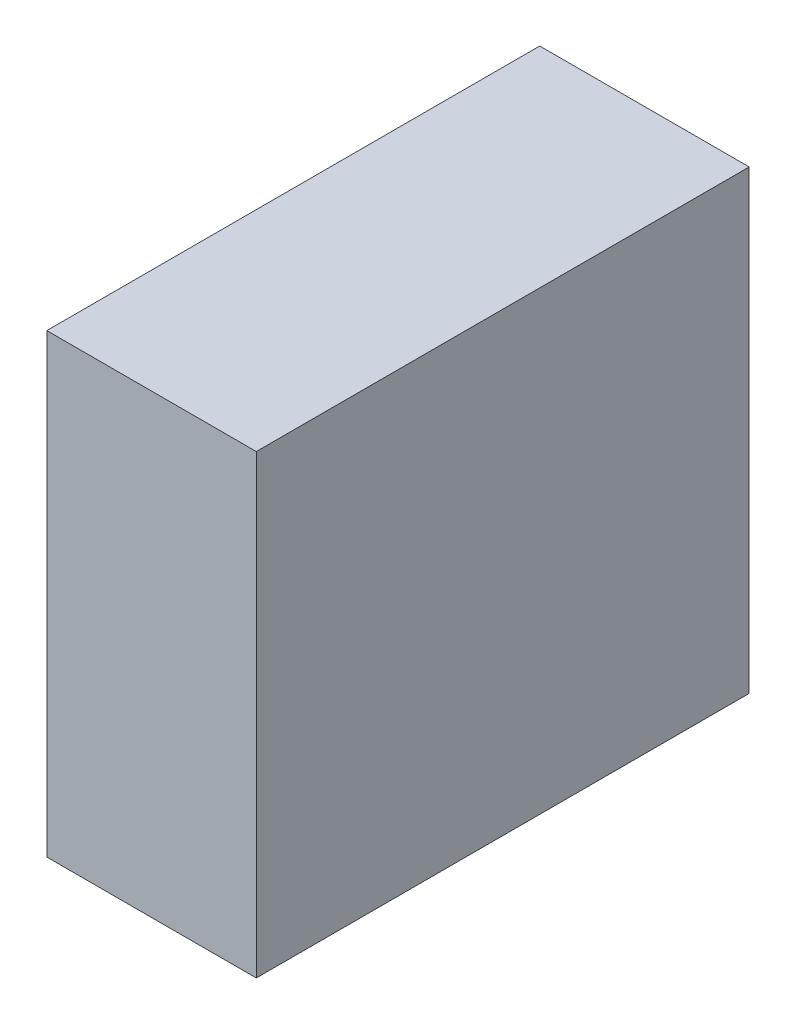
ISO-10303-21;
HEADER;
FILE_DESCRIPTION(('STEP AP214'),'2;1');
FILE_NAME('part.step','',(''),(''),'','','');
FILE_SCHEMA(('AUTOMOTIVE_DESIGN { 1 0 10303 214 1 1 1 1 }'));
ENDSEC;
DATA;
#1=APPLICATION_CONTEXT('core data for automotive mechanical design processes');
#2=APPLICATION_PROTOCOL_DEFINITION('international standard','automotive_design',2000,#1);
#3=PRODUCT_CONTEXT('',#1,'mechanical');
#4=PRODUCT('Part','Part','',(#3));
#5=PRODUCT_RELATED_PRODUCT_CATEGORY('part','',(#4));
#6=PRODUCT_DEFINITION_FORMATION('','',#4);
#7=PRODUCT_DEFINITION_CONTEXT('part definition',#1,'design');
#8=PRODUCT_DEFINITION('design','',#6,#7);
#9=PRODUCT_DEFINITION_SHAPE('','',#8);
#10=(LENGTH_UNIT() NAMED_UNIT(*) SI_UNIT(.MILLI.,.METRE.));
#11=(NAMED_UNIT(*) PLANE_ANGLE_UNIT() SI_UNIT($,.RADIAN.));
#12=(NAMED_UNIT(*) SI_UNIT($,.STERADIAN.) SOLID_ANGLE_UNIT());
#13=UNCERTAINTY_MEASURE_WITH_UNIT(LENGTH_MEASURE(1.E-05),#10,'distance_accuracy_value','');
#14=(GEOMETRIC_REPRESENTATION_CONTEXT(3) GLOBAL_UNCERTAINTY_ASSIGNED_CONTEXT((#13)) GLOBAL_UNIT_ASSIGNED_CONTEXT((#10,
#11,#12)) REPRESENTATION_CONTEXT('',''));
#15=CARTESIAN_POINT('',(0.,0.,0.));
#16=DIRECTION('',(0.,0.,1.));
#17=DIRECTION('',(1.,0.,0.));
#18=AXIS2_PLACEMENT_3D('',#15,#16,#17);
#19=CARTESIAN_POINT('',(0.,0.,400.));
#20=DIRECTION('',(1.,0.,0.));
#21=DIRECTION('',(0.,0.,-1.));
#22=AXIS2_PLACEMENT_3D('',#19,#20,#21);
#23=PLANE('',#22);
#24=DIRECTION('',(0.,-1.,0.));
#25=VECTOR('',#24,1.);
#26=CARTESIAN_POINT('',(0.,0.,0.));
#27=LINE('',#26,#25);
#28=CARTESIAN_POINT('',(0.,370.,0.));
#29=VERTEX_POINT('',#28);
#30=CARTESIAN_POINT('',(0.,0.,0.));
#31=VERTEX_POINT('',#30);
#32=EDGE_CURVE('E94',#29,#31,#27,.T.);
#33=ORIENTED_EDGE('',*,*,#32,.T.);
#34=DIRECTION('',(0.,0.,-1.));
#35=VECTOR('',#34,1.);
#36=CARTESIAN_POINT('',(0.,0.,400.));
#37=LINE('',#36,#35);
#38=CARTESIAN_POINT('',(0.,0.,400.));
#39=VERTEX_POINT('',#38);
#40=EDGE_CURVE('E11',#39,#31,#37,.T.);
#41=ORIENTED_EDGE('',*,*,#40,.F.);
#42=DIRECTION('',(0.,-1.,0.));
#43=VECTOR('',#42,1.);
#44=CARTESIAN_POINT('',(0.,0.,400.));
#45=LINE('',#44,#43);
#46=CARTESIAN_POINT('',(0.,370.,400.));
#47=VERTEX_POINT('',#46);
#48=EDGE_CURVE('E82',#47,#39,#45,.T.);
#49=ORIENTED_EDGE('',*,*,#48,.F.);
#50=DIRECTION('',(0.,0.,-1.));
#51=VECTOR('',#50,1.);
#52=CARTESIAN_POINT('',(0.,370.,400.));
#53=LINE('',#52,#51);
#54=EDGE_CURVE('E90',#47,#29,#53,.T.);
#55=ORIENTED_EDGE('',*,*,#54,.T.);
#56=EDGE_LOOP('',(#33,#41,#49,#55));
#57=FACE_BOUND('',#56,.T.);
#58=ADVANCED_FACE('F31',(#57),#23,.F.);
#59=CARTESIAN_POINT('',(0.,0.,400.));
#60=DIRECTION('',(0.,1.,0.));
#61=DIRECTION('',(0.,0.,1.));
#62=AXIS2_PLACEMENT_3D('',#59,#60,#61);
#63=PLANE('',#62);
#64=DIRECTION('',(1.,0.,0.));
#65=VECTOR('',#64,1.);
#66=CARTESIAN_POINT('',(0.,0.,0.));
#67=LINE('',#66,#65);
#68=CARTESIAN_POINT('',(170.,0.,0.));
#69=VERTEX_POINT('',#68);
#70=EDGE_CURVE('E86',#31,#69,#67,.T.);
#71=ORIENTED_EDGE('',*,*,#70,.T.);
#72=DIRECTION('',(0.,0.,-1.));
#73=VECTOR('',#72,1.);
#74=CARTESIAN_POINT('',(170.,0.,400.));
#75=LINE('',#74,#73);
#76=CARTESIAN_POINT('',(170.,0.,400.));
#77=VERTEX_POINT('',#76);
#78=EDGE_CURVE('E39',#77,#69,#75,.T.);
#79=ORIENTED_EDGE('',*,*,#78,.F.);
#80=DIRECTION('',(1.,0.,0.));
#81=VECTOR('',#80,1.);
#82=CARTESIAN_POINT('',(0.,0.,400.));
#83=LINE('',#82,#81);
#84=EDGE_CURVE('E77',#39,#77,#83,.T.);
#85=ORIENTED_EDGE('',*,*,#84,.F.);
#86=ORIENTED_EDGE('',*,*,#40,.T.);
#87=EDGE_LOOP('',(#71,#79,#85,#86));
#88=FACE_BOUND('',#87,.T.);
#89=ADVANCED_FACE('F85',(#88),#63,.F.);
#90=CARTESIAN_POINT('',(170.,0.,400.));
#91=DIRECTION('',(-1.,0.,0.));
#92=DIRECTION('',(0.,0.,1.));
#93=AXIS2_PLACEMENT_3D('',#90,#91,#92);
#94=PLANE('',#93);
#95=DIRECTION('',(0.,1.,0.));
#96=VECTOR('',#95,1.);
#97=CARTESIAN_POINT('',(170.,0.,0.));
#98=LINE('',#97,#96);
#99=CARTESIAN_POINT('',(170.,370.,0.));
#100=VERTEX_POINT('',#99);
#101=EDGE_CURVE('E64',#69,#100,#98,.T.);
#102=ORIENTED_EDGE('',*,*,#101,.T.);
#103=DIRECTION('',(0.,0.,-1.));
#104=VECTOR('',#103,1.);
#105=CARTESIAN_POINT('',(170.,370.,400.));
#106=LINE('',#105,#104);
#107=CARTESIAN_POINT('',(170.,370.,400.));
#108=VERTEX_POINT('',#107);
#109=EDGE_CURVE('E87',#108,#100,#106,.T.);
#110=ORIENTED_EDGE('',*,*,#109,.F.);
#111=DIRECTION('',(0.,1.,0.));
#112=VECTOR('',#111,1.);
#113=CARTESIAN_POINT('',(170.,0.,400.));
#114=LINE('',#113,#112);
#115=EDGE_CURVE('E80',#77,#108,#114,.T.);
#116=ORIENTED_EDGE('',*,*,#115,.F.);
#117=ORIENTED_EDGE('',*,*,#78,.T.);
#118=EDGE_LOOP('',(#102,#110,#116,#117));
#119=FACE_BOUND('',#118,.T.);
#120=ADVANCED_FACE('F88',(#119),#94,.F.);
#121=CARTESIAN_POINT('',(0.,370.,400.));
#122=DIRECTION('',(0.,-1.,0.));
#123=DIRECTION('',(0.,0.,-1.));
#124=AXIS2_PLACEMENT_3D('',#121,#122,#123);
#125=PLANE('',#124);
#126=DIRECTION('',(-1.,0.,0.));
#127=VECTOR('',#126,1.);
#128=CARTESIAN_POINT('',(0.,370.,0.));
#129=LINE('',#128,#127);
#130=EDGE_CURVE('E70',#100,#29,#129,.T.);
#131=ORIENTED_EDGE('',*,*,#130,.T.);
#132=ORIENTED_EDGE('',*,*,#54,.F.);
#133=DIRECTION('',(-1.,0.,0.));
#134=VECTOR('',#133,1.);
#135=CARTESIAN_POINT('',(0.,370.,400.));
#136=LINE('',#135,#134);
#137=EDGE_CURVE('E47',#108,#47,#136,.T.);
#138=ORIENTED_EDGE('',*,*,#137,.F.);
#139=ORIENTED_EDGE('',*,*,#109,.T.);
#140=EDGE_LOOP('',(#131,#132,#138,#139));
#141=FACE_BOUND('',#140,.T.);
#142=ADVANCED_FACE('F101',(#141),#125,.F.);
#143=CARTESIAN_POINT('',(0.,370.,400.));
#144=DIRECTION('',(0.,0.,-1.));
#145=DIRECTION('',(-1.,0.,0.));
#146=AXIS2_PLACEMENT_3D('',#143,#144,#145);
#147=PLANE('',#146);
#148=ORIENTED_EDGE('',*,*,#48,.T.);
#149=ORIENTED_EDGE('',*,*,#84,.T.);
#150=ORIENTED_EDGE('',*,*,#115,.T.);
#151=ORIENTED_EDGE('',*,*,#137,.T.);
#152=EDGE_LOOP('',(#148,#149,#150,#151));
#153=FACE_BOUND('',#152,.T.);
#154=ADVANCED_FACE('F78',(#153),#147,.F.);
#155=CARTESIAN_POINT('',(0.,370.,0.));
#156=DIRECTION('',(0.,0.,-1.));
#157=DIRECTION('',(-1.,0.,0.));
#158=AXIS2_PLACEMENT_3D('',#155,#156,#157);
#159=PLANE('',#158);
#160=ORIENTED_EDGE('',*,*,#32,.F.);
#161=ORIENTED_EDGE('',*,*,#130,.F.);
#162=ORIENTED_EDGE('',*,*,#101,.F.);
#163=ORIENTED_EDGE('',*,*,#70,.F.);
#164=EDGE_LOOP('',(#160,#161,#162,#163));
#165=FACE_BOUND('',#164,.T.);
#166=ADVANCED_FACE('F104',(#165),#159,.T.);
#167=CLOSED_SHELL('',(#58,#89,#120,#142,#154,#166));
#168=MANIFOLD_SOLID_BREP('B2',#167);
#169=ADVANCED_BREP_SHAPE_REPRESENTATION('',(#18,#168),#14);
#170=SHAPE_DEFINITION_REPRESENTATION(#9,#169);
ENDSEC;
END-ISO-10303-21;
